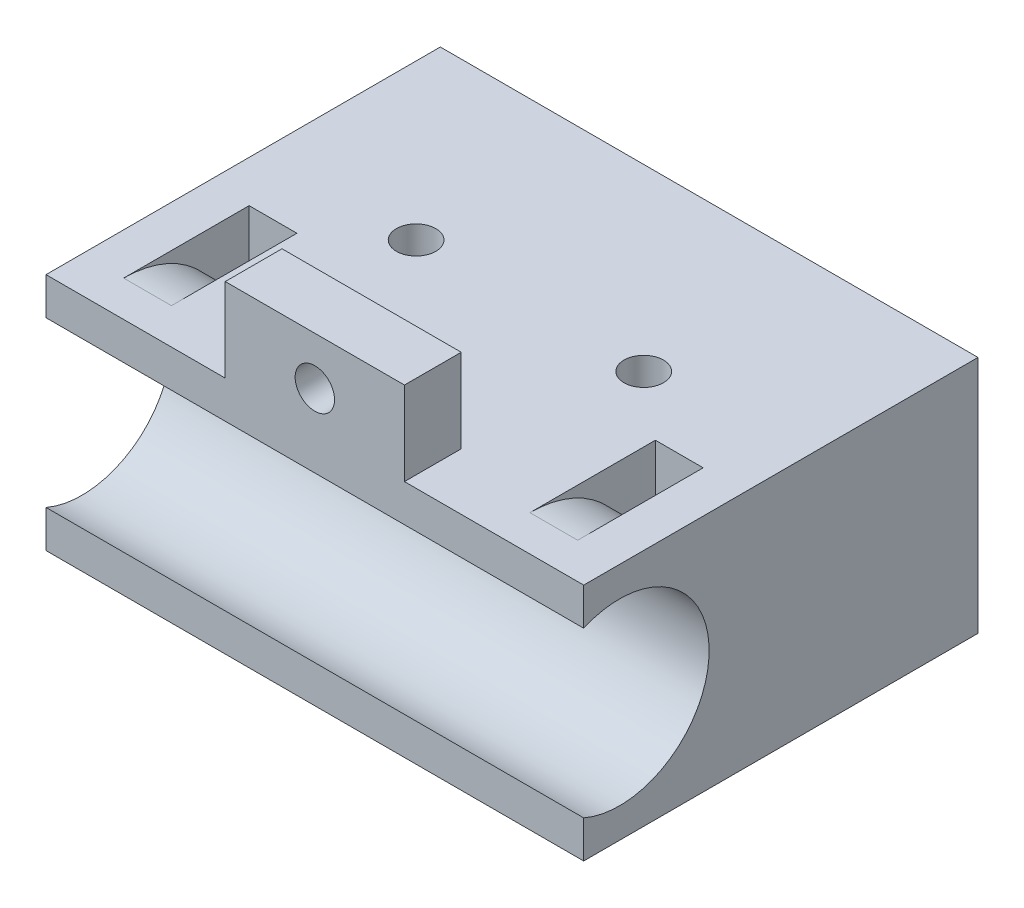
ISO-10303-21;
HEADER;
FILE_DESCRIPTION(('STEP AP214'),'2;1');
FILE_NAME('part.step','',(''),(''),'','','');
FILE_SCHEMA(('AUTOMOTIVE_DESIGN { 1 0 10303 214 1 1 1 1 }'));
ENDSEC;
DATA;
#1=APPLICATION_CONTEXT('core data for automotive mechanical design processes');
#2=APPLICATION_PROTOCOL_DEFINITION('international standard','automotive_design',2000,#1);
#3=PRODUCT_CONTEXT('',#1,'mechanical');
#4=PRODUCT('Part','Part','',(#3));
#5=PRODUCT_RELATED_PRODUCT_CATEGORY('part','',(#4));
#6=PRODUCT_DEFINITION_FORMATION('','',#4);
#7=PRODUCT_DEFINITION_CONTEXT('part definition',#1,'design');
#8=PRODUCT_DEFINITION('design','',#6,#7);
#9=PRODUCT_DEFINITION_SHAPE('','',#8);
#10=(LENGTH_UNIT() NAMED_UNIT(*) SI_UNIT(.MILLI.,.METRE.));
#11=(NAMED_UNIT(*) PLANE_ANGLE_UNIT() SI_UNIT($,.RADIAN.));
#12=(NAMED_UNIT(*) SI_UNIT($,.STERADIAN.) SOLID_ANGLE_UNIT());
#13=UNCERTAINTY_MEASURE_WITH_UNIT(LENGTH_MEASURE(1.E-05),#10,'distance_accuracy_value','');
#14=(GEOMETRIC_REPRESENTATION_CONTEXT(3) GLOBAL_UNCERTAINTY_ASSIGNED_CONTEXT((#13)) GLOBAL_UNIT_ASSIGNED_CONTEXT((#10,
#11,#12)) REPRESENTATION_CONTEXT('',''));
#15=CARTESIAN_POINT('',(0.,0.,0.));
#16=DIRECTION('',(0.,0.,1.));
#17=DIRECTION('',(1.,0.,0.));
#18=AXIS2_PLACEMENT_3D('',#15,#16,#17);
#19=CARTESIAN_POINT('',(-22.5,2.99999999999984,33.));
#20=DIRECTION('',(0.,-1.,0.));
#21=DIRECTION('',(1.,0.,0.));
#22=AXIS2_PLACEMENT_3D('',#19,#20,#21);
#23=PLANE('',#22);
#24=DIRECTION('',(-1.,0.,0.));
#25=VECTOR('',#24,1.);
#26=CARTESIAN_POINT('',(15.,3.0000000000001,30.));
#27=LINE('',#26,#25);
#28=CARTESIAN_POINT('',(19.,3.00000000000013,30.));
#29=VERTEX_POINT('',#28);
#30=CARTESIAN_POINT('',(15.,3.0000000000001,30.));
#31=VERTEX_POINT('',#30);
#32=EDGE_CURVE('E346',#29,#31,#27,.T.);
#33=ORIENTED_EDGE('',*,*,#32,.T.);
#34=DIRECTION('',(0.,0.,-1.));
#35=VECTOR('',#34,1.);
#36=CARTESIAN_POINT('',(15.,3.0000000000001,0.));
#37=LINE('',#36,#35);
#38=CARTESIAN_POINT('',(15.,3.0000000000001,19.5));
#39=VERTEX_POINT('',#38);
#40=EDGE_CURVE('E218',#31,#39,#37,.T.);
#41=ORIENTED_EDGE('',*,*,#40,.T.);
#42=DIRECTION('',(-1.,0.,0.));
#43=VECTOR('',#42,1.);
#44=CARTESIAN_POINT('',(0.,3.,19.5));
#45=LINE('',#44,#43);
#46=CARTESIAN_POINT('',(19.,3.00000000000013,19.5));
#47=VERTEX_POINT('',#46);
#48=EDGE_CURVE('E232',#47,#39,#45,.T.);
#49=ORIENTED_EDGE('',*,*,#48,.F.);
#50=DIRECTION('',(0.,0.,-1.));
#51=VECTOR('',#50,1.);
#52=CARTESIAN_POINT('',(19.,3.00000000000013,0.));
#53=LINE('',#52,#51);
#54=EDGE_CURVE('E229',#29,#47,#53,.T.);
#55=ORIENTED_EDGE('',*,*,#54,.F.);
#56=EDGE_LOOP('',(#33,#41,#49,#55));
#57=FACE_BOUND('',#56,.T.);
#58=CARTESIAN_POINT('',(-9.52500000000004,2.99999999999993,15.));
#59=DIRECTION('',(0.,1.,0.));
#60=DIRECTION('',(0.,0.,-1.));
#61=AXIS2_PLACEMENT_3D('',#58,#59,#60);
#62=CIRCLE('',#61,1.65);
#63=CARTESIAN_POINT('',(-9.52500000000004,2.99999999999993,13.35));
#64=VERTEX_POINT('',#63);
#65=EDGE_CURVE('E271',#64,#64,#62,.T.);
#66=ORIENTED_EDGE('',*,*,#65,.F.);
#67=EDGE_LOOP('',(#66));
#68=FACE_BOUND('',#67,.T.);
#69=CARTESIAN_POINT('',(9.52499999999996,3.00000000000007,15.));
#70=DIRECTION('',(0.,1.,0.));
#71=DIRECTION('',(0.,0.,-1.));
#72=AXIS2_PLACEMENT_3D('',#69,#70,#71);
#73=CIRCLE('',#72,1.65);
#74=CARTESIAN_POINT('',(9.52499999999996,3.00000000000007,13.35));
#75=VERTEX_POINT('',#74);
#76=EDGE_CURVE('E278',#75,#75,#73,.T.);
#77=ORIENTED_EDGE('',*,*,#76,.F.);
#78=EDGE_LOOP('',(#77));
#79=FACE_BOUND('',#78,.T.);
#80=DIRECTION('',(-1.,0.,0.));
#81=VECTOR('',#80,1.);
#82=CARTESIAN_POINT('',(-19.,2.99999999999986,30.));
#83=LINE('',#82,#81);
#84=CARTESIAN_POINT('',(-15.,2.99999999999989,30.));
#85=VERTEX_POINT('',#84);
#86=CARTESIAN_POINT('',(-19.,2.99999999999986,30.));
#87=VERTEX_POINT('',#86);
#88=EDGE_CURVE('E349',#85,#87,#83,.T.);
#89=ORIENTED_EDGE('',*,*,#88,.T.);
#90=DIRECTION('',(0.,0.,1.));
#91=VECTOR('',#90,1.);
#92=CARTESIAN_POINT('',(-19.,2.99999999999986,0.));
#93=LINE('',#92,#91);
#94=CARTESIAN_POINT('',(-19.,2.99999999999986,19.5));
#95=VERTEX_POINT('',#94);
#96=EDGE_CURVE('E207',#95,#87,#93,.T.);
#97=ORIENTED_EDGE('',*,*,#96,.F.);
#98=DIRECTION('',(-1.,0.,0.));
#99=VECTOR('',#98,1.);
#100=CARTESIAN_POINT('',(0.,3.,19.5));
#101=LINE('',#100,#99);
#102=CARTESIAN_POINT('',(-15.,2.99999999999989,19.5));
#103=VERTEX_POINT('',#102);
#104=EDGE_CURVE('E205',#103,#95,#101,.T.);
#105=ORIENTED_EDGE('',*,*,#104,.F.);
#106=DIRECTION('',(0.,0.,1.));
#107=VECTOR('',#106,1.);
#108=CARTESIAN_POINT('',(-15.,2.99999999999989,0.));
#109=LINE('',#108,#107);
#110=EDGE_CURVE('E213',#103,#85,#109,.T.);
#111=ORIENTED_EDGE('',*,*,#110,.T.);
#112=EDGE_LOOP('',(#89,#97,#105,#111));
#113=FACE_BOUND('',#112,.T.);
#114=DIRECTION('',(0.,0.,-1.));
#115=VECTOR('',#114,1.);
#116=CARTESIAN_POINT('',(7.49999999999995,3.00000000000005,28.25));
#117=LINE('',#116,#115);
#118=CARTESIAN_POINT('',(7.49999999999995,3.00000000000005,33.));
#119=VERTEX_POINT('',#118);
#120=CARTESIAN_POINT('',(7.49999999999995,3.00000000000005,28.25));
#121=VERTEX_POINT('',#120);
#122=EDGE_CURVE('E203',#119,#121,#117,.T.);
#123=ORIENTED_EDGE('',*,*,#122,.F.);
#124=DIRECTION('',(-1.,0.,0.));
#125=VECTOR('',#124,1.);
#126=CARTESIAN_POINT('',(-22.5,2.99999999999984,33.));
#127=LINE('',#126,#125);
#128=CARTESIAN_POINT('',(22.5,3.00000000000016,33.));
#129=VERTEX_POINT('',#128);
#130=EDGE_CURVE('E290',#129,#119,#127,.T.);
#131=ORIENTED_EDGE('',*,*,#130,.F.);
#132=DIRECTION('',(0.,0.,-1.));
#133=VECTOR('',#132,1.);
#134=CARTESIAN_POINT('',(22.5,3.00000000000016,33.));
#135=LINE('',#134,#133);
#136=CARTESIAN_POINT('',(22.5,3.00000000000016,0.));
#137=VERTEX_POINT('',#136);
#138=EDGE_CURVE('E316',#129,#137,#135,.T.);
#139=ORIENTED_EDGE('',*,*,#138,.T.);
#140=DIRECTION('',(-1.,0.,0.));
#141=VECTOR('',#140,1.);
#142=CARTESIAN_POINT('',(-22.5,2.99999999999984,0.));
#143=LINE('',#142,#141);
#144=CARTESIAN_POINT('',(-22.5,2.99999999999984,0.));
#145=VERTEX_POINT('',#144);
#146=EDGE_CURVE('E302',#137,#145,#143,.T.);
#147=ORIENTED_EDGE('',*,*,#146,.T.);
#148=DIRECTION('',(0.,0.,-1.));
#149=VECTOR('',#148,1.);
#150=CARTESIAN_POINT('',(-22.5,2.99999999999984,33.));
#151=LINE('',#150,#149);
#152=CARTESIAN_POINT('',(-22.5,2.99999999999984,33.));
#153=VERTEX_POINT('',#152);
#154=EDGE_CURVE('E313',#153,#145,#151,.T.);
#155=ORIENTED_EDGE('',*,*,#154,.F.);
#156=CARTESIAN_POINT('',(-7.50000000000005,2.99999999999994,33.));
#157=VERTEX_POINT('',#156);
#158=EDGE_CURVE('E288',#157,#153,#127,.T.);
#159=ORIENTED_EDGE('',*,*,#158,.F.);
#160=DIRECTION('',(0.,0.,1.));
#161=VECTOR('',#160,1.);
#162=CARTESIAN_POINT('',(-7.50000000000005,2.99999999999994,28.25));
#163=LINE('',#162,#161);
#164=CARTESIAN_POINT('',(-7.50000000000005,2.99999999999994,28.25));
#165=VERTEX_POINT('',#164);
#166=EDGE_CURVE('E199',#165,#157,#163,.T.);
#167=ORIENTED_EDGE('',*,*,#166,.F.);
#168=DIRECTION('',(-1.,0.,0.));
#169=VECTOR('',#168,1.);
#170=CARTESIAN_POINT('',(7.49999999999995,3.00000000000005,28.25));
#171=LINE('',#170,#169);
#172=EDGE_CURVE('E393',#121,#165,#171,.T.);
#173=ORIENTED_EDGE('',*,*,#172,.F.);
#174=EDGE_LOOP('',(#123,#131,#139,#147,#155,#159,#167,#173));
#175=FACE_BOUND('',#174,.T.);
#176=ADVANCED_FACE('F37',(#57,#68,#79,#113,#175),#23,.F.);
#177=CARTESIAN_POINT('',(-22.4999999999999,-17.0000000000002,33.));
#178=DIRECTION('',(0.,1.,0.));
#179=DIRECTION('',(-1.,0.,0.));
#180=AXIS2_PLACEMENT_3D('',#177,#178,#179);
#181=PLANE('',#180);
#182=DIRECTION('',(0.,0.,1.));
#183=VECTOR('',#182,1.);
#184=CARTESIAN_POINT('',(-14.9999999999999,-17.0000000000001,33.));
#185=LINE('',#184,#183);
#186=CARTESIAN_POINT('',(-14.9999999999999,-17.0000000000001,19.5));
#187=VERTEX_POINT('',#186);
#188=CARTESIAN_POINT('',(-14.9999999999999,-17.0000000000001,21.));
#189=VERTEX_POINT('',#188);
#190=EDGE_CURVE('E341',#187,#189,#185,.T.);
#191=ORIENTED_EDGE('',*,*,#190,.F.);
#192=DIRECTION('',(-1.,0.,0.));
#193=VECTOR('',#192,1.);
#194=CARTESIAN_POINT('',(-22.4999999999999,-17.0000000000002,19.5));
#195=LINE('',#194,#193);
#196=CARTESIAN_POINT('',(-18.9999999999999,-17.0000000000001,19.5));
#197=VERTEX_POINT('',#196);
#198=EDGE_CURVE('E343',#187,#197,#195,.T.);
#199=ORIENTED_EDGE('',*,*,#198,.T.);
#200=DIRECTION('',(0.,0.,1.));
#201=VECTOR('',#200,1.);
#202=CARTESIAN_POINT('',(-18.9999999999999,-17.0000000000001,33.));
#203=LINE('',#202,#201);
#204=CARTESIAN_POINT('',(-18.9999999999999,-17.0000000000001,21.));
#205=VERTEX_POINT('',#204);
#206=EDGE_CURVE('E335',#197,#205,#203,.T.);
#207=ORIENTED_EDGE('',*,*,#206,.T.);
#208=DIRECTION('',(-1.,0.,0.));
#209=VECTOR('',#208,1.);
#210=CARTESIAN_POINT('',(-22.4999999999999,-17.0000000000002,21.));
#211=LINE('',#210,#209);
#212=EDGE_CURVE('E338',#189,#205,#211,.T.);
#213=ORIENTED_EDGE('',*,*,#212,.F.);
#214=EDGE_LOOP('',(#191,#199,#207,#213));
#215=FACE_BOUND('',#214,.T.);
#216=DIRECTION('',(1.,0.,0.));
#217=VECTOR('',#216,1.);
#218=CARTESIAN_POINT('',(-22.4999999999999,-17.0000000000002,0.));
#219=LINE('',#218,#217);
#220=CARTESIAN_POINT('',(-22.4999999999999,-17.0000000000002,0.));
#221=VERTEX_POINT('',#220);
#222=CARTESIAN_POINT('',(22.5000000000001,-16.9999999999998,0.));
#223=VERTEX_POINT('',#222);
#224=EDGE_CURVE('E306',#221,#223,#219,.T.);
#225=ORIENTED_EDGE('',*,*,#224,.T.);
#226=DIRECTION('',(0.,0.,-1.));
#227=VECTOR('',#226,1.);
#228=CARTESIAN_POINT('',(22.5000000000001,-16.9999999999998,33.));
#229=LINE('',#228,#227);
#230=CARTESIAN_POINT('',(22.5000000000001,-16.9999999999998,33.));
#231=VERTEX_POINT('',#230);
#232=EDGE_CURVE('E299',#231,#223,#229,.T.);
#233=ORIENTED_EDGE('',*,*,#232,.F.);
#234=DIRECTION('',(1.,0.,0.));
#235=VECTOR('',#234,1.);
#236=CARTESIAN_POINT('',(-22.4999999999999,-17.0000000000002,33.));
#237=LINE('',#236,#235);
#238=CARTESIAN_POINT('',(-22.4999999999999,-17.0000000000002,33.));
#239=VERTEX_POINT('',#238);
#240=EDGE_CURVE('E297',#239,#231,#237,.T.);
#241=ORIENTED_EDGE('',*,*,#240,.F.);
#242=DIRECTION('',(0.,0.,-1.));
#243=VECTOR('',#242,1.);
#244=CARTESIAN_POINT('',(-22.4999999999999,-17.0000000000002,33.));
#245=LINE('',#244,#243);
#246=EDGE_CURVE('E310',#239,#221,#245,.T.);
#247=ORIENTED_EDGE('',*,*,#246,.T.);
#248=EDGE_LOOP('',(#225,#233,#241,#247));
#249=FACE_BOUND('',#248,.T.);
#250=CARTESIAN_POINT('',(9.52500000000009,-16.9999999999999,15.));
#251=DIRECTION('',(0.,1.,0.));
#252=DIRECTION('',(0.,0.,-1.));
#253=AXIS2_PLACEMENT_3D('',#250,#251,#252);
#254=CIRCLE('',#253,1.65);
#255=CARTESIAN_POINT('',(9.52500000000009,-16.9999999999999,13.35));
#256=VERTEX_POINT('',#255);
#257=EDGE_CURVE('E281',#256,#256,#254,.T.);
#258=ORIENTED_EDGE('',*,*,#257,.T.);
#259=EDGE_LOOP('',(#258));
#260=FACE_BOUND('',#259,.T.);
#261=CARTESIAN_POINT('',(-9.52499999999991,-17.0000000000001,15.));
#262=DIRECTION('',(0.,1.,0.));
#263=DIRECTION('',(0.,0.,-1.));
#264=AXIS2_PLACEMENT_3D('',#261,#262,#263);
#265=CIRCLE('',#264,1.65);
#266=CARTESIAN_POINT('',(-9.52499999999991,-17.0000000000001,13.35));
#267=VERTEX_POINT('',#266);
#268=EDGE_CURVE('E275',#267,#267,#265,.T.);
#269=ORIENTED_EDGE('',*,*,#268,.T.);
#270=EDGE_LOOP('',(#269));
#271=FACE_BOUND('',#270,.T.);
#272=CARTESIAN_POINT('',(9.52500000000009,-16.9999999999999,5.));
#273=DIRECTION('',(0.,-1.,0.));
#274=DIRECTION('',(0.,0.,1.));
#275=AXIS2_PLACEMENT_3D('',#272,#273,#274);
#276=CIRCLE('',#275,1.24999999999999);
#277=CARTESIAN_POINT('',(9.52500000000009,-16.9999999999999,6.24999999999999));
#278=VERTEX_POINT('',#277);
#279=EDGE_CURVE('E249',#278,#278,#276,.T.);
#280=ORIENTED_EDGE('',*,*,#279,.F.);
#281=EDGE_LOOP('',(#280));
#282=FACE_BOUND('',#281,.T.);
#283=CARTESIAN_POINT('',(-9.5249999999999,-17.0000000000001,5.));
#284=DIRECTION('',(0.,-1.,0.));
#285=DIRECTION('',(0.,0.,1.));
#286=AXIS2_PLACEMENT_3D('',#283,#284,#285);
#287=CIRCLE('',#286,1.24999999999999);
#288=CARTESIAN_POINT('',(-9.5249999999999,-17.0000000000001,6.24999999999999));
#289=VERTEX_POINT('',#288);
#290=EDGE_CURVE('E238',#289,#289,#287,.T.);
#291=ORIENTED_EDGE('',*,*,#290,.F.);
#292=EDGE_LOOP('',(#291));
#293=FACE_BOUND('',#292,.T.);
#294=DIRECTION('',(0.,0.,-1.));
#295=VECTOR('',#294,1.);
#296=CARTESIAN_POINT('',(15.0000000000001,-16.9999999999999,33.));
#297=LINE('',#296,#295);
#298=CARTESIAN_POINT('',(15.0000000000001,-16.9999999999999,21.));
#299=VERTEX_POINT('',#298);
#300=CARTESIAN_POINT('',(15.0000000000001,-16.9999999999999,19.5));
#301=VERTEX_POINT('',#300);
#302=EDGE_CURVE('E333',#299,#301,#297,.T.);
#303=ORIENTED_EDGE('',*,*,#302,.F.);
#304=DIRECTION('',(-1.,0.,0.));
#305=VECTOR('',#304,1.);
#306=CARTESIAN_POINT('',(-22.4999999999999,-17.0000000000002,21.));
#307=LINE('',#306,#305);
#308=CARTESIAN_POINT('',(19.0000000000001,-16.9999999999999,21.));
#309=VERTEX_POINT('',#308);
#310=EDGE_CURVE('E325',#309,#299,#307,.T.);
#311=ORIENTED_EDGE('',*,*,#310,.F.);
#312=DIRECTION('',(0.,0.,-1.));
#313=VECTOR('',#312,1.);
#314=CARTESIAN_POINT('',(19.0000000000001,-16.9999999999999,33.));
#315=LINE('',#314,#313);
#316=CARTESIAN_POINT('',(19.0000000000001,-16.9999999999999,19.5));
#317=VERTEX_POINT('',#316);
#318=EDGE_CURVE('E327',#309,#317,#315,.T.);
#319=ORIENTED_EDGE('',*,*,#318,.T.);
#320=DIRECTION('',(-1.,0.,0.));
#321=VECTOR('',#320,1.);
#322=CARTESIAN_POINT('',(-22.4999999999999,-17.0000000000002,19.5));
#323=LINE('',#322,#321);
#324=EDGE_CURVE('E330',#317,#301,#323,.T.);
#325=ORIENTED_EDGE('',*,*,#324,.T.);
#326=EDGE_LOOP('',(#303,#311,#319,#325));
#327=FACE_BOUND('',#326,.T.);
#328=ADVANCED_FACE('F375',(#215,#249,#260,#271,#282,#293,#327),#181,.F.);
#329=CARTESIAN_POINT('',(0.,-7.,33.));
#330=DIRECTION('',(0.,0.,-1.));
#331=DIRECTION('',(1.,0.,0.));
#332=AXIS2_PLACEMENT_3D('',#329,#330,#331);
#333=PLANE('',#332);
#334=DIRECTION('',(0.,1.,0.));
#335=VECTOR('',#334,1.);
#336=CARTESIAN_POINT('',(22.5000000000001,-16.9999999999998,33.));
#337=LINE('',#336,#335);
#338=CARTESIAN_POINT('',(22.5000000000001,-13.8738635424336,33.));
#339=VERTEX_POINT('',#338);
#340=EDGE_CURVE('E285',#231,#339,#337,.T.);
#341=ORIENTED_EDGE('',*,*,#340,.T.);
#342=DIRECTION('',(-1.,0.,0.));
#343=VECTOR('',#342,1.);
#344=CARTESIAN_POINT('',(22.5000000000001,-13.8738635424336,33.));
#345=LINE('',#344,#343);
#346=CARTESIAN_POINT('',(-22.4999999999999,-13.8738635424339,33.));
#347=VERTEX_POINT('',#346);
#348=EDGE_CURVE('E322',#339,#347,#345,.T.);
#349=ORIENTED_EDGE('',*,*,#348,.T.);
#350=DIRECTION('',(0.,-1.,0.));
#351=VECTOR('',#350,1.);
#352=CARTESIAN_POINT('',(-22.4999999999999,-17.0000000000002,33.));
#353=LINE('',#352,#351);
#354=EDGE_CURVE('E293',#347,#239,#353,.T.);
#355=ORIENTED_EDGE('',*,*,#354,.T.);
#356=ORIENTED_EDGE('',*,*,#240,.T.);
#357=EDGE_LOOP('',(#341,#349,#355,#356));
#358=FACE_BOUND('',#357,.T.);
#359=ADVANCED_FACE('F420',(#358),#333,.F.);
#360=CARTESIAN_POINT('',(22.5000000000001,-16.9999999999998,33.));
#361=DIRECTION('',(-1.,0.,0.));
#362=DIRECTION('',(0.,-1.,0.));
#363=AXIS2_PLACEMENT_3D('',#360,#361,#362);
#364=PLANE('',#363);
#365=CARTESIAN_POINT('',(22.5,-0.126136457566075,33.));
#366=VERTEX_POINT('',#365);
#367=EDGE_CURVE('E289',#366,#129,#337,.T.);
#368=ORIENTED_EDGE('',*,*,#367,.F.);
#369=CARTESIAN_POINT('',(22.5,-6.99999999999984,30.));
#370=DIRECTION('',(-1.,0.,0.));
#371=DIRECTION('',(0.,-1.,0.));
#372=AXIS2_PLACEMENT_3D('',#369,#370,#371);
#373=CIRCLE('',#372,7.5);
#374=EDGE_CURVE('E268',#366,#339,#373,.T.);
#375=ORIENTED_EDGE('',*,*,#374,.T.);
#376=ORIENTED_EDGE('',*,*,#340,.F.);
#377=ORIENTED_EDGE('',*,*,#232,.T.);
#378=DIRECTION('',(0.,1.,0.));
#379=VECTOR('',#378,1.);
#380=CARTESIAN_POINT('',(22.5000000000001,-16.9999999999998,0.));
#381=LINE('',#380,#379);
#382=EDGE_CURVE('E284',#223,#137,#381,.T.);
#383=ORIENTED_EDGE('',*,*,#382,.T.);
#384=ORIENTED_EDGE('',*,*,#138,.F.);
#385=EDGE_LOOP('',(#368,#375,#376,#377,#383,#384));
#386=FACE_BOUND('',#385,.T.);
#387=ADVANCED_FACE('F400',(#386),#364,.F.);
#388=CARTESIAN_POINT('',(-22.4999999999999,-17.0000000000002,33.));
#389=DIRECTION('',(1.,0.,0.));
#390=DIRECTION('',(0.,1.,0.));
#391=AXIS2_PLACEMENT_3D('',#388,#389,#390);
#392=PLANE('',#391);
#393=ORIENTED_EDGE('',*,*,#354,.F.);
#394=CARTESIAN_POINT('',(-22.5,-7.00000000000017,30.));
#395=DIRECTION('',(-1.,0.,0.));
#396=DIRECTION('',(0.,-1.,0.));
#397=AXIS2_PLACEMENT_3D('',#394,#395,#396);
#398=CIRCLE('',#397,7.5);
#399=CARTESIAN_POINT('',(-22.5,-0.126136457566407,33.));
#400=VERTEX_POINT('',#399);
#401=EDGE_CURVE('E265',#400,#347,#398,.T.);
#402=ORIENTED_EDGE('',*,*,#401,.F.);
#403=EDGE_CURVE('E294',#153,#400,#353,.T.);
#404=ORIENTED_EDGE('',*,*,#403,.F.);
#405=ORIENTED_EDGE('',*,*,#154,.T.);
#406=DIRECTION('',(0.,-1.,0.));
#407=VECTOR('',#406,1.);
#408=CARTESIAN_POINT('',(-22.4999999999999,-17.0000000000002,0.));
#409=LINE('',#408,#407);
#410=EDGE_CURVE('E304',#145,#221,#409,.T.);
#411=ORIENTED_EDGE('',*,*,#410,.T.);
#412=ORIENTED_EDGE('',*,*,#246,.F.);
#413=EDGE_LOOP('',(#393,#402,#404,#405,#411,#412));
#414=FACE_BOUND('',#413,.T.);
#415=ADVANCED_FACE('F410',(#414),#392,.F.);
#416=CARTESIAN_POINT('',(0.,6.,33.));
#417=DIRECTION('',(0.,0.,-1.));
#418=DIRECTION('',(1.,0.,0.));
#419=AXIS2_PLACEMENT_3D('',#416,#417,#418);
#420=CIRCLE('',#419,1.65);
#421=CARTESIAN_POINT('',(1.64999999999994,6.00000000000001,33.));
#422=VERTEX_POINT('',#421);
#423=EDGE_CURVE('E394',#422,#422,#420,.T.);
#424=ORIENTED_EDGE('',*,*,#423,.T.);
#425=EDGE_LOOP('',(#424));
#426=FACE_BOUND('',#425,.T.);
#427=ORIENTED_EDGE('',*,*,#403,.T.);
#428=DIRECTION('',(-1.,0.,0.));
#429=VECTOR('',#428,1.);
#430=CARTESIAN_POINT('',(22.5,-0.126136457566079,33.));
#431=LINE('',#430,#429);
#432=EDGE_CURVE('E319',#400,#366,#431,.F.);
#433=ORIENTED_EDGE('',*,*,#432,.T.);
#434=ORIENTED_EDGE('',*,*,#367,.T.);
#435=ORIENTED_EDGE('',*,*,#130,.T.);
#436=DIRECTION('',(0.,-1.,0.));
#437=VECTOR('',#436,1.);
#438=CARTESIAN_POINT('',(7.4999999999999,10.0000000000001,33.));
#439=LINE('',#438,#437);
#440=CARTESIAN_POINT('',(7.4999999999999,10.0000000000001,33.));
#441=VERTEX_POINT('',#440);
#442=EDGE_CURVE('E397',#441,#119,#439,.T.);
#443=ORIENTED_EDGE('',*,*,#442,.F.);
#444=DIRECTION('',(1.,0.,0.));
#445=VECTOR('',#444,1.);
#446=CARTESIAN_POINT('',(7.4999999999999,10.0000000000001,33.));
#447=LINE('',#446,#445);
#448=CARTESIAN_POINT('',(-7.5000000000001,9.99999999999994,33.));
#449=VERTEX_POINT('',#448);
#450=EDGE_CURVE('E196',#449,#441,#447,.T.);
#451=ORIENTED_EDGE('',*,*,#450,.F.);
#452=DIRECTION('',(0.,-1.,0.));
#453=VECTOR('',#452,1.);
#454=CARTESIAN_POINT('',(-7.5000000000001,9.99999999999994,33.));
#455=LINE('',#454,#453);
#456=EDGE_CURVE('E52',#449,#157,#455,.T.);
#457=ORIENTED_EDGE('',*,*,#456,.T.);
#458=ORIENTED_EDGE('',*,*,#158,.T.);
#459=EDGE_LOOP('',(#427,#433,#434,#435,#443,#451,#457,#458));
#460=FACE_BOUND('',#459,.T.);
#461=ADVANCED_FACE('F396',(#426,#460),#333,.F.);
#462=CARTESIAN_POINT('',(0.,-7.,0.));
#463=DIRECTION('',(0.,0.,-1.));
#464=DIRECTION('',(1.,0.,0.));
#465=AXIS2_PLACEMENT_3D('',#462,#463,#464);
#466=PLANE('',#465);
#467=CARTESIAN_POINT('',(15.,-6.9999999999999,0.));
#468=DIRECTION('',(0.,0.,-1.));
#469=DIRECTION('',(1.,0.,0.));
#470=AXIS2_PLACEMENT_3D('',#467,#468,#469);
#471=CIRCLE('',#470,4.);
#472=CARTESIAN_POINT('',(19.,-6.99999999999987,0.));
#473=VERTEX_POINT('',#472);
#474=EDGE_CURVE('E255',#473,#473,#471,.T.);
#475=ORIENTED_EDGE('',*,*,#474,.F.);
#476=EDGE_LOOP('',(#475));
#477=FACE_BOUND('',#476,.T.);
#478=CARTESIAN_POINT('',(-15.,-7.00000000000011,0.));
#479=DIRECTION('',(0.,0.,-1.));
#480=DIRECTION('',(1.,0.,0.));
#481=AXIS2_PLACEMENT_3D('',#478,#479,#480);
#482=CIRCLE('',#481,4.);
#483=CARTESIAN_POINT('',(-11.,-7.00000000000008,0.));
#484=VERTEX_POINT('',#483);
#485=EDGE_CURVE('E259',#484,#484,#482,.T.);
#486=ORIENTED_EDGE('',*,*,#485,.F.);
#487=EDGE_LOOP('',(#486));
#488=FACE_BOUND('',#487,.T.);
#489=ORIENTED_EDGE('',*,*,#382,.F.);
#490=ORIENTED_EDGE('',*,*,#224,.F.);
#491=ORIENTED_EDGE('',*,*,#410,.F.);
#492=ORIENTED_EDGE('',*,*,#146,.F.);
#493=EDGE_LOOP('',(#489,#490,#491,#492));
#494=FACE_BOUND('',#493,.T.);
#495=ADVANCED_FACE('F414',(#477,#488,#494),#466,.T.);
#496=CARTESIAN_POINT('',(9.52499999999996,3.00000000000007,15.));
#497=DIRECTION('',(0.,1.,0.));
#498=DIRECTION('',(0.,0.,-1.));
#499=AXIS2_PLACEMENT_3D('',#496,#497,#498);
#500=CYLINDRICAL_SURFACE('',#499,1.65);
#501=ORIENTED_EDGE('',*,*,#257,.F.);
#502=EDGE_LOOP('',(#501));
#503=FACE_BOUND('',#502,.T.);
#504=ORIENTED_EDGE('',*,*,#76,.T.);
#505=EDGE_LOOP('',(#504));
#506=FACE_BOUND('',#505,.T.);
#507=ADVANCED_FACE('F511',(#503,#506),#500,.F.);
#508=CARTESIAN_POINT('',(-9.52500000000004,2.99999999999993,15.));
#509=DIRECTION('',(0.,1.,0.));
#510=DIRECTION('',(0.,0.,-1.));
#511=AXIS2_PLACEMENT_3D('',#508,#509,#510);
#512=CYLINDRICAL_SURFACE('',#511,1.65);
#513=ORIENTED_EDGE('',*,*,#268,.F.);
#514=EDGE_LOOP('',(#513));
#515=FACE_BOUND('',#514,.T.);
#516=ORIENTED_EDGE('',*,*,#65,.T.);
#517=EDGE_LOOP('',(#516));
#518=FACE_BOUND('',#517,.T.);
#519=ADVANCED_FACE('F508',(#515,#518),#512,.F.);
#520=CARTESIAN_POINT('',(22.5,-6.99999999999984,30.));
#521=DIRECTION('',(-1.,0.,0.));
#522=DIRECTION('',(0.,-1.,0.));
#523=AXIS2_PLACEMENT_3D('',#520,#521,#522);
#524=CYLINDRICAL_SURFACE('',#523,7.5);
#525=ORIENTED_EDGE('',*,*,#374,.F.);
#526=ORIENTED_EDGE('',*,*,#432,.F.);
#527=ORIENTED_EDGE('',*,*,#401,.T.);
#528=ORIENTED_EDGE('',*,*,#348,.F.);
#529=EDGE_LOOP('',(#525,#526,#527,#528));
#530=FACE_BOUND('',#529,.T.);
#531=ADVANCED_FACE('F504',(#530),#524,.F.);
#532=CARTESIAN_POINT('',(-15.,-7.00000000000011,10.));
#533=DIRECTION('',(0.,0.,-1.));
#534=DIRECTION('',(1.,0.,0.));
#535=AXIS2_PLACEMENT_3D('',#532,#533,#534);
#536=CYLINDRICAL_SURFACE('',#535,4.);
#537=CARTESIAN_POINT('',(-15.,-7.00000000000011,10.));
#538=DIRECTION('',(0.,0.,-1.));
#539=DIRECTION('',(1.,0.,0.));
#540=AXIS2_PLACEMENT_3D('',#537,#538,#539);
#541=CIRCLE('',#540,4.);
#542=CARTESIAN_POINT('',(-11.,-7.00000000000008,10.));
#543=VERTEX_POINT('',#542);
#544=EDGE_CURVE('E262',#543,#543,#541,.T.);
#545=ORIENTED_EDGE('',*,*,#544,.F.);
#546=EDGE_LOOP('',(#545));
#547=FACE_BOUND('',#546,.T.);
#548=ORIENTED_EDGE('',*,*,#485,.T.);
#549=EDGE_LOOP('',(#548));
#550=FACE_BOUND('',#549,.T.);
#551=ADVANCED_FACE('F500',(#547,#550),#536,.F.);
#552=CARTESIAN_POINT('',(0.,-7.,10.));
#553=DIRECTION('',(0.,0.,-1.));
#554=DIRECTION('',(1.,0.,0.));
#555=AXIS2_PLACEMENT_3D('',#552,#553,#554);
#556=PLANE('',#555);
#557=ORIENTED_EDGE('',*,*,#544,.T.);
#558=EDGE_LOOP('',(#557));
#559=FACE_BOUND('',#558,.T.);
#560=ADVANCED_FACE('F496',(#559),#556,.T.);
#561=CARTESIAN_POINT('',(15.,-6.9999999999999,10.));
#562=DIRECTION('',(0.,0.,-1.));
#563=DIRECTION('',(1.,0.,0.));
#564=AXIS2_PLACEMENT_3D('',#561,#562,#563);
#565=CYLINDRICAL_SURFACE('',#564,4.);
#566=CARTESIAN_POINT('',(15.,-6.9999999999999,10.));
#567=DIRECTION('',(0.,0.,-1.));
#568=DIRECTION('',(1.,0.,0.));
#569=AXIS2_PLACEMENT_3D('',#566,#567,#568);
#570=CIRCLE('',#569,4.);
#571=CARTESIAN_POINT('',(19.,-6.99999999999987,10.));
#572=VERTEX_POINT('',#571);
#573=EDGE_CURVE('E256',#572,#572,#570,.T.);
#574=ORIENTED_EDGE('',*,*,#573,.F.);
#575=EDGE_LOOP('',(#574));
#576=FACE_BOUND('',#575,.T.);
#577=ORIENTED_EDGE('',*,*,#474,.T.);
#578=EDGE_LOOP('',(#577));
#579=FACE_BOUND('',#578,.T.);
#580=ADVANCED_FACE('F492',(#576,#579),#565,.F.);
#581=CARTESIAN_POINT('',(0.,-7.,10.));
#582=DIRECTION('',(0.,0.,-1.));
#583=DIRECTION('',(1.,0.,0.));
#584=AXIS2_PLACEMENT_3D('',#581,#582,#583);
#585=PLANE('',#584);
#586=ORIENTED_EDGE('',*,*,#573,.T.);
#587=EDGE_LOOP('',(#586));
#588=FACE_BOUND('',#587,.T.);
#589=ADVANCED_FACE('F488',(#588),#585,.T.);
#590=CARTESIAN_POINT('',(9.52500000000004,-8.49999999999987,5.));
#591=DIRECTION('',(0.,-1.,0.));
#592=DIRECTION('',(0.,0.,1.));
#593=AXIS2_PLACEMENT_3D('',#590,#591,#592);
#594=CONICAL_SURFACE('',#593,1.25,1.02974425867665);
#595=CARTESIAN_POINT('',(9.52500000000003,-7.74892422621542,5.));
#596=VERTEX_POINT('',#595);
#597=VERTEX_LOOP('',#596);
#598=FACE_BOUND('',#597,.T.);
#599=CARTESIAN_POINT('',(9.52500000000004,-8.49999999999987,5.));
#600=DIRECTION('',(0.,-1.,0.));
#601=DIRECTION('',(0.,0.,1.));
#602=AXIS2_PLACEMENT_3D('',#599,#600,#601);
#603=CIRCLE('',#602,1.25);
#604=CARTESIAN_POINT('',(9.52500000000004,-8.49999999999987,6.25));
#605=VERTEX_POINT('',#604);
#606=EDGE_CURVE('E252',#605,#605,#603,.T.);
#607=ORIENTED_EDGE('',*,*,#606,.T.);
#608=EDGE_LOOP('',(#607));
#609=FACE_BOUND('',#608,.T.);
#610=ADVANCED_FACE('F484',(#598,#609),#594,.F.);
#611=CARTESIAN_POINT('',(9.52500000000009,-16.9999999999999,5.));
#612=DIRECTION('',(0.,-1.,0.));
#613=DIRECTION('',(0.,0.,1.));
#614=AXIS2_PLACEMENT_3D('',#611,#612,#613);
#615=CYLINDRICAL_SURFACE('',#614,1.24999999999999);
#616=ORIENTED_EDGE('',*,*,#606,.F.);
#617=EDGE_LOOP('',(#616));
#618=FACE_BOUND('',#617,.T.);
#619=ORIENTED_EDGE('',*,*,#279,.T.);
#620=EDGE_LOOP('',(#619));
#621=FACE_BOUND('',#620,.T.);
#622=ADVANCED_FACE('F480',(#618,#621),#615,.F.);
#623=CARTESIAN_POINT('',(-9.52499999999996,-8.50000000000014,5.));
#624=DIRECTION('',(0.,-1.,0.));
#625=DIRECTION('',(0.,0.,1.));
#626=AXIS2_PLACEMENT_3D('',#623,#624,#625);
#627=CONICAL_SURFACE('',#626,1.25,1.02974425867665);
#628=CARTESIAN_POINT('',(-9.52499999999997,-7.74892422621568,5.));
#629=VERTEX_POINT('',#628);
#630=VERTEX_LOOP('',#629);
#631=FACE_BOUND('',#630,.T.);
#632=CARTESIAN_POINT('',(-9.52499999999996,-8.50000000000014,5.));
#633=DIRECTION('',(0.,-1.,0.));
#634=DIRECTION('',(0.,0.,1.));
#635=AXIS2_PLACEMENT_3D('',#632,#633,#634);
#636=CIRCLE('',#635,1.25);
#637=CARTESIAN_POINT('',(-9.52499999999996,-8.50000000000014,6.25));
#638=VERTEX_POINT('',#637);
#639=EDGE_CURVE('E246',#638,#638,#636,.T.);
#640=ORIENTED_EDGE('',*,*,#639,.T.);
#641=EDGE_LOOP('',(#640));
#642=FACE_BOUND('',#641,.T.);
#643=ADVANCED_FACE('F476',(#631,#642),#627,.F.);
#644=CARTESIAN_POINT('',(-9.5249999999999,-17.0000000000001,5.));
#645=DIRECTION('',(0.,-1.,0.));
#646=DIRECTION('',(0.,0.,1.));
#647=AXIS2_PLACEMENT_3D('',#644,#645,#646);
#648=CYLINDRICAL_SURFACE('',#647,1.24999999999999);
#649=ORIENTED_EDGE('',*,*,#639,.F.);
#650=EDGE_LOOP('',(#649));
#651=FACE_BOUND('',#650,.T.);
#652=ORIENTED_EDGE('',*,*,#290,.T.);
#653=EDGE_LOOP('',(#652));
#654=FACE_BOUND('',#653,.T.);
#655=ADVANCED_FACE('F473',(#651,#654),#648,.F.);
#656=CARTESIAN_POINT('',(15.0000000000002,-35.9999999999999,0.));
#657=DIRECTION('',(1.,0.,0.));
#658=DIRECTION('',(0.,1.,0.));
#659=AXIS2_PLACEMENT_3D('',#656,#657,#658);
#660=PLANE('',#659);
#661=ORIENTED_EDGE('',*,*,#302,.T.);
#662=DIRECTION('',(0.,1.,0.));
#663=VECTOR('',#662,1.);
#664=CARTESIAN_POINT('',(15.0000000000002,-35.9999999999999,19.5));
#665=LINE('',#664,#663);
#666=EDGE_CURVE('E236',#301,#39,#665,.T.);
#667=ORIENTED_EDGE('',*,*,#666,.T.);
#668=ORIENTED_EDGE('',*,*,#40,.F.);
#669=CARTESIAN_POINT('',(15.,-5.99999999999989,30.));
#670=DIRECTION('',(1.,0.,0.));
#671=DIRECTION('',(0.,1.,0.));
#672=AXIS2_PLACEMENT_3D('',#669,#670,#671);
#673=CIRCLE('',#672,9.);
#674=CARTESIAN_POINT('',(15.,-5.9999999999999,21.));
#675=VERTEX_POINT('',#674);
#676=EDGE_CURVE('E45',#31,#675,#673,.F.);
#677=ORIENTED_EDGE('',*,*,#676,.T.);
#678=DIRECTION('',(0.,1.,0.));
#679=VECTOR('',#678,1.);
#680=CARTESIAN_POINT('',(15.0000000000002,-35.9999999999999,21.));
#681=LINE('',#680,#679);
#682=EDGE_CURVE('E235',#299,#675,#681,.T.);
#683=ORIENTED_EDGE('',*,*,#682,.F.);
#684=EDGE_LOOP('',(#661,#667,#668,#677,#683));
#685=FACE_BOUND('',#684,.T.);
#686=ADVANCED_FACE('F362',(#685),#660,.T.);
#687=CARTESIAN_POINT('',(2.31366537383618E-13,-36.,19.5));
#688=DIRECTION('',(0.,0.,-1.));
#689=DIRECTION('',(1.,0.,0.));
#690=AXIS2_PLACEMENT_3D('',#687,#688,#689);
#691=PLANE('',#690);
#692=DIRECTION('',(0.,1.,0.));
#693=VECTOR('',#692,1.);
#694=CARTESIAN_POINT('',(19.0000000000002,-35.9999999999999,19.5));
#695=LINE('',#694,#693);
#696=EDGE_CURVE('E239',#317,#47,#695,.T.);
#697=ORIENTED_EDGE('',*,*,#696,.T.);
#698=ORIENTED_EDGE('',*,*,#48,.T.);
#699=ORIENTED_EDGE('',*,*,#666,.F.);
#700=ORIENTED_EDGE('',*,*,#324,.F.);
#701=EDGE_LOOP('',(#697,#698,#699,#700));
#702=FACE_BOUND('',#701,.T.);
#703=ADVANCED_FACE('F378',(#702),#691,.F.);
#704=CARTESIAN_POINT('',(19.0000000000002,-35.9999999999999,0.));
#705=DIRECTION('',(1.,0.,0.));
#706=DIRECTION('',(0.,1.,0.));
#707=AXIS2_PLACEMENT_3D('',#704,#705,#706);
#708=PLANE('',#707);
#709=DIRECTION('',(0.,1.,0.));
#710=VECTOR('',#709,1.);
#711=CARTESIAN_POINT('',(19.0000000000002,-35.9999999999999,21.));
#712=LINE('',#711,#710);
#713=CARTESIAN_POINT('',(19.,-5.99999999999987,21.));
#714=VERTEX_POINT('',#713);
#715=EDGE_CURVE('E241',#309,#714,#712,.T.);
#716=ORIENTED_EDGE('',*,*,#715,.T.);
#717=CARTESIAN_POINT('',(19.,-5.99999999999987,30.));
#718=DIRECTION('',(1.,0.,0.));
#719=DIRECTION('',(0.,1.,0.));
#720=AXIS2_PLACEMENT_3D('',#717,#718,#719);
#721=CIRCLE('',#720,9.);
#722=EDGE_CURVE('E11',#714,#29,#721,.T.);
#723=ORIENTED_EDGE('',*,*,#722,.T.);
#724=ORIENTED_EDGE('',*,*,#54,.T.);
#725=ORIENTED_EDGE('',*,*,#696,.F.);
#726=ORIENTED_EDGE('',*,*,#318,.F.);
#727=EDGE_LOOP('',(#716,#723,#724,#725,#726));
#728=FACE_BOUND('',#727,.T.);
#729=ADVANCED_FACE('F370',(#728),#708,.F.);
#730=CARTESIAN_POINT('',(2.31366537383618E-13,-36.,21.));
#731=DIRECTION('',(0.,0.,-1.));
#732=DIRECTION('',(1.,0.,0.));
#733=AXIS2_PLACEMENT_3D('',#730,#731,#732);
#734=PLANE('',#733);
#735=ORIENTED_EDGE('',*,*,#682,.T.);
#736=DIRECTION('',(-1.,0.,0.));
#737=VECTOR('',#736,1.);
#738=CARTESIAN_POINT('',(19.,-5.99999999999987,21.));
#739=LINE('',#738,#737);
#740=EDGE_CURVE('E60',#675,#714,#739,.F.);
#741=ORIENTED_EDGE('',*,*,#740,.T.);
#742=ORIENTED_EDGE('',*,*,#715,.F.);
#743=ORIENTED_EDGE('',*,*,#310,.T.);
#744=EDGE_LOOP('',(#735,#741,#742,#743));
#745=FACE_BOUND('',#744,.T.);
#746=ADVANCED_FACE('F366',(#745),#734,.T.);
#747=CARTESIAN_POINT('',(2.31366537383618E-13,-36.,19.5));
#748=DIRECTION('',(0.,0.,-1.));
#749=DIRECTION('',(1.,0.,0.));
#750=AXIS2_PLACEMENT_3D('',#747,#748,#749);
#751=PLANE('',#750);
#752=DIRECTION('',(0.,1.,0.));
#753=VECTOR('',#752,1.);
#754=CARTESIAN_POINT('',(-14.9999999999998,-36.0000000000001,19.5));
#755=LINE('',#754,#753);
#756=EDGE_CURVE('E216',#187,#103,#755,.T.);
#757=ORIENTED_EDGE('',*,*,#756,.T.);
#758=ORIENTED_EDGE('',*,*,#104,.T.);
#759=DIRECTION('',(0.,1.,0.));
#760=VECTOR('',#759,1.);
#761=CARTESIAN_POINT('',(-18.9999999999998,-36.0000000000001,19.5));
#762=LINE('',#761,#760);
#763=EDGE_CURVE('E215',#197,#95,#762,.T.);
#764=ORIENTED_EDGE('',*,*,#763,.F.);
#765=ORIENTED_EDGE('',*,*,#198,.F.);
#766=EDGE_LOOP('',(#757,#758,#764,#765));
#767=FACE_BOUND('',#766,.T.);
#768=ADVANCED_FACE('F452',(#767),#751,.F.);
#769=CARTESIAN_POINT('',(-14.9999999999998,-36.0000000000001,0.));
#770=DIRECTION('',(-1.,0.,0.));
#771=DIRECTION('',(0.,-1.,0.));
#772=AXIS2_PLACEMENT_3D('',#769,#770,#771);
#773=PLANE('',#772);
#774=ORIENTED_EDGE('',*,*,#190,.T.);
#775=DIRECTION('',(0.,1.,0.));
#776=VECTOR('',#775,1.);
#777=CARTESIAN_POINT('',(-14.9999999999998,-36.0000000000001,21.));
#778=LINE('',#777,#776);
#779=CARTESIAN_POINT('',(-15.,-6.00000000000011,21.));
#780=VERTEX_POINT('',#779);
#781=EDGE_CURVE('E219',#189,#780,#778,.T.);
#782=ORIENTED_EDGE('',*,*,#781,.T.);
#783=CARTESIAN_POINT('',(-15.,-6.00000000000011,30.));
#784=DIRECTION('',(-1.,0.,0.));
#785=DIRECTION('',(0.,-1.,0.));
#786=AXIS2_PLACEMENT_3D('',#783,#784,#785);
#787=CIRCLE('',#786,9.);
#788=EDGE_CURVE('E357',#780,#85,#787,.F.);
#789=ORIENTED_EDGE('',*,*,#788,.T.);
#790=ORIENTED_EDGE('',*,*,#110,.F.);
#791=ORIENTED_EDGE('',*,*,#756,.F.);
#792=EDGE_LOOP('',(#774,#782,#789,#790,#791));
#793=FACE_BOUND('',#792,.T.);
#794=ADVANCED_FACE('F448',(#793),#773,.T.);
#795=CARTESIAN_POINT('',(2.31366537383618E-13,-36.,21.));
#796=DIRECTION('',(0.,0.,-1.));
#797=DIRECTION('',(1.,0.,0.));
#798=AXIS2_PLACEMENT_3D('',#795,#796,#797);
#799=PLANE('',#798);
#800=DIRECTION('',(0.,1.,0.));
#801=VECTOR('',#800,1.);
#802=CARTESIAN_POINT('',(-18.9999999999998,-36.0000000000001,21.));
#803=LINE('',#802,#801);
#804=CARTESIAN_POINT('',(-19.,-6.00000000000014,21.));
#805=VERTEX_POINT('',#804);
#806=EDGE_CURVE('E222',#205,#805,#803,.T.);
#807=ORIENTED_EDGE('',*,*,#806,.T.);
#808=DIRECTION('',(-1.,0.,0.));
#809=VECTOR('',#808,1.);
#810=CARTESIAN_POINT('',(-15.,-6.00000000000011,21.));
#811=LINE('',#810,#809);
#812=EDGE_CURVE('E352',#805,#780,#811,.F.);
#813=ORIENTED_EDGE('',*,*,#812,.T.);
#814=ORIENTED_EDGE('',*,*,#781,.F.);
#815=ORIENTED_EDGE('',*,*,#212,.T.);
#816=EDGE_LOOP('',(#807,#813,#814,#815));
#817=FACE_BOUND('',#816,.T.);
#818=ADVANCED_FACE('F451',(#817),#799,.T.);
#819=CARTESIAN_POINT('',(-18.9999999999998,-36.0000000000001,0.));
#820=DIRECTION('',(-1.,0.,0.));
#821=DIRECTION('',(0.,-1.,0.));
#822=AXIS2_PLACEMENT_3D('',#819,#820,#821);
#823=PLANE('',#822);
#824=ORIENTED_EDGE('',*,*,#763,.T.);
#825=ORIENTED_EDGE('',*,*,#96,.T.);
#826=CARTESIAN_POINT('',(-19.,-6.00000000000014,30.));
#827=DIRECTION('',(-1.,0.,0.));
#828=DIRECTION('',(0.,-1.,0.));
#829=AXIS2_PLACEMENT_3D('',#826,#827,#828);
#830=CIRCLE('',#829,9.);
#831=EDGE_CURVE('E355',#87,#805,#830,.T.);
#832=ORIENTED_EDGE('',*,*,#831,.T.);
#833=ORIENTED_EDGE('',*,*,#806,.F.);
#834=ORIENTED_EDGE('',*,*,#206,.F.);
#835=EDGE_LOOP('',(#824,#825,#832,#833,#834));
#836=FACE_BOUND('',#835,.T.);
#837=ADVANCED_FACE('F456',(#836),#823,.F.);
#838=CARTESIAN_POINT('',(-22.5,-6.00000000000016,30.));
#839=DIRECTION('',(1.,0.,0.));
#840=DIRECTION('',(0.,1.,0.));
#841=AXIS2_PLACEMENT_3D('',#838,#839,#840);
#842=CYLINDRICAL_SURFACE('',#841,9.);
#843=ORIENTED_EDGE('',*,*,#788,.F.);
#844=ORIENTED_EDGE('',*,*,#812,.F.);
#845=ORIENTED_EDGE('',*,*,#831,.F.);
#846=ORIENTED_EDGE('',*,*,#88,.F.);
#847=EDGE_LOOP('',(#843,#844,#845,#846));
#848=FACE_BOUND('',#847,.T.);
#849=ADVANCED_FACE('F460',(#848),#842,.T.);
#850=CARTESIAN_POINT('',(-22.5,-6.00000000000016,30.));
#851=DIRECTION('',(1.,0.,0.));
#852=DIRECTION('',(0.,1.,0.));
#853=AXIS2_PLACEMENT_3D('',#850,#851,#852);
#854=CYLINDRICAL_SURFACE('',#853,9.);
#855=ORIENTED_EDGE('',*,*,#722,.F.);
#856=ORIENTED_EDGE('',*,*,#740,.F.);
#857=ORIENTED_EDGE('',*,*,#676,.F.);
#858=ORIENTED_EDGE('',*,*,#32,.F.);
#859=EDGE_LOOP('',(#855,#856,#857,#858));
#860=FACE_BOUND('',#859,.T.);
#861=ADVANCED_FACE('F39',(#860),#854,.T.);
#862=CARTESIAN_POINT('',(7.4999999999999,10.0000000000001,28.25));
#863=DIRECTION('',(-1.,0.,0.));
#864=DIRECTION('',(0.,0.,-1.));
#865=AXIS2_PLACEMENT_3D('',#862,#863,#864);
#866=PLANE('',#865);
#867=ORIENTED_EDGE('',*,*,#122,.T.);
#868=DIRECTION('',(0.,-1.,0.));
#869=VECTOR('',#868,1.);
#870=CARTESIAN_POINT('',(7.4999999999999,10.0000000000001,28.25));
#871=LINE('',#870,#869);
#872=CARTESIAN_POINT('',(7.4999999999999,10.0000000000001,28.25));
#873=VERTEX_POINT('',#872);
#874=EDGE_CURVE('E185',#873,#121,#871,.T.);
#875=ORIENTED_EDGE('',*,*,#874,.F.);
#876=DIRECTION('',(0.,0.,-1.));
#877=VECTOR('',#876,1.);
#878=CARTESIAN_POINT('',(7.4999999999999,10.0000000000001,28.25));
#879=LINE('',#878,#877);
#880=EDGE_CURVE('E192',#441,#873,#879,.T.);
#881=ORIENTED_EDGE('',*,*,#880,.F.);
#882=ORIENTED_EDGE('',*,*,#442,.T.);
#883=EDGE_LOOP('',(#867,#875,#881,#882));
#884=FACE_BOUND('',#883,.T.);
#885=ADVANCED_FACE('F201',(#884),#866,.F.);
#886=CARTESIAN_POINT('',(7.4999999999999,10.0000000000001,28.25));
#887=DIRECTION('',(0.,0.,1.));
#888=DIRECTION('',(-1.,0.,0.));
#889=AXIS2_PLACEMENT_3D('',#886,#887,#888);
#890=PLANE('',#889);
#891=CARTESIAN_POINT('',(0.,6.,28.25));
#892=DIRECTION('',(0.,0.,-1.));
#893=DIRECTION('',(1.,0.,0.));
#894=AXIS2_PLACEMENT_3D('',#891,#892,#893);
#895=CIRCLE('',#894,1.64999999999999);
#896=CARTESIAN_POINT('',(1.64999999999993,6.00000000000001,28.25));
#897=VERTEX_POINT('',#896);
#898=EDGE_CURVE('E431',#897,#897,#895,.T.);
#899=ORIENTED_EDGE('',*,*,#898,.F.);
#900=EDGE_LOOP('',(#899));
#901=FACE_BOUND('',#900,.T.);
#902=ORIENTED_EDGE('',*,*,#172,.T.);
#903=DIRECTION('',(0.,-1.,0.));
#904=VECTOR('',#903,1.);
#905=CARTESIAN_POINT('',(-7.5000000000001,9.99999999999994,28.25));
#906=LINE('',#905,#904);
#907=CARTESIAN_POINT('',(-7.5000000000001,9.99999999999994,28.25));
#908=VERTEX_POINT('',#907);
#909=EDGE_CURVE('E188',#908,#165,#906,.T.);
#910=ORIENTED_EDGE('',*,*,#909,.F.);
#911=DIRECTION('',(-1.,0.,0.));
#912=VECTOR('',#911,1.);
#913=CARTESIAN_POINT('',(7.4999999999999,10.0000000000001,28.25));
#914=LINE('',#913,#912);
#915=EDGE_CURVE('E181',#873,#908,#914,.T.);
#916=ORIENTED_EDGE('',*,*,#915,.F.);
#917=ORIENTED_EDGE('',*,*,#874,.T.);
#918=EDGE_LOOP('',(#902,#910,#916,#917));
#919=FACE_BOUND('',#918,.T.);
#920=ADVANCED_FACE('F183',(#901,#919),#890,.F.);
#921=CARTESIAN_POINT('',(-7.5000000000001,9.99999999999994,28.25));
#922=DIRECTION('',(1.,0.,0.));
#923=DIRECTION('',(0.,0.,1.));
#924=AXIS2_PLACEMENT_3D('',#921,#922,#923);
#925=PLANE('',#924);
#926=ORIENTED_EDGE('',*,*,#166,.T.);
#927=ORIENTED_EDGE('',*,*,#456,.F.);
#928=DIRECTION('',(0.,0.,1.));
#929=VECTOR('',#928,1.);
#930=CARTESIAN_POINT('',(-7.5000000000001,9.99999999999994,28.25));
#931=LINE('',#930,#929);
#932=EDGE_CURVE('E191',#908,#449,#931,.T.);
#933=ORIENTED_EDGE('',*,*,#932,.F.);
#934=ORIENTED_EDGE('',*,*,#909,.T.);
#935=EDGE_LOOP('',(#926,#927,#933,#934));
#936=FACE_BOUND('',#935,.T.);
#937=ADVANCED_FACE('F438',(#936),#925,.F.);
#938=CARTESIAN_POINT('',(0.,10.,0.));
#939=DIRECTION('',(0.,-1.,0.));
#940=DIRECTION('',(1.,0.,0.));
#941=AXIS2_PLACEMENT_3D('',#938,#939,#940);
#942=PLANE('',#941);
#943=ORIENTED_EDGE('',*,*,#880,.T.);
#944=ORIENTED_EDGE('',*,*,#915,.T.);
#945=ORIENTED_EDGE('',*,*,#932,.T.);
#946=ORIENTED_EDGE('',*,*,#450,.T.);
#947=EDGE_LOOP('',(#943,#944,#945,#946));
#948=FACE_BOUND('',#947,.T.);
#949=ADVANCED_FACE('F195',(#948),#942,.F.);
#950=CARTESIAN_POINT('',(0.,6.,28.25));
#951=DIRECTION('',(0.,0.,-1.));
#952=DIRECTION('',(1.,0.,0.));
#953=AXIS2_PLACEMENT_3D('',#950,#951,#952);
#954=CYLINDRICAL_SURFACE('',#953,1.64999999999999);
#955=ORIENTED_EDGE('',*,*,#423,.F.);
#956=EDGE_LOOP('',(#955));
#957=FACE_BOUND('',#956,.T.);
#958=ORIENTED_EDGE('',*,*,#898,.T.);
#959=EDGE_LOOP('',(#958));
#960=FACE_BOUND('',#959,.T.);
#961=ADVANCED_FACE('F435',(#957,#960),#954,.F.);
#962=CLOSED_SHELL('',(#176,#328,#359,#387,#415,#461,#495,#507,#519,#531,#551,#560,#580,#589,
#610,#622,#643,#655,#686,#703,#729,#746,#768,#794,#818,#837,#849,#861,#885,#920,#937,#949,#961));
#963=MANIFOLD_SOLID_BREP('B2',#962);
#964=ADVANCED_BREP_SHAPE_REPRESENTATION('',(#18,#963),#14);
#965=SHAPE_DEFINITION_REPRESENTATION(#9,#964);
ENDSEC;
END-ISO-10303-21;
